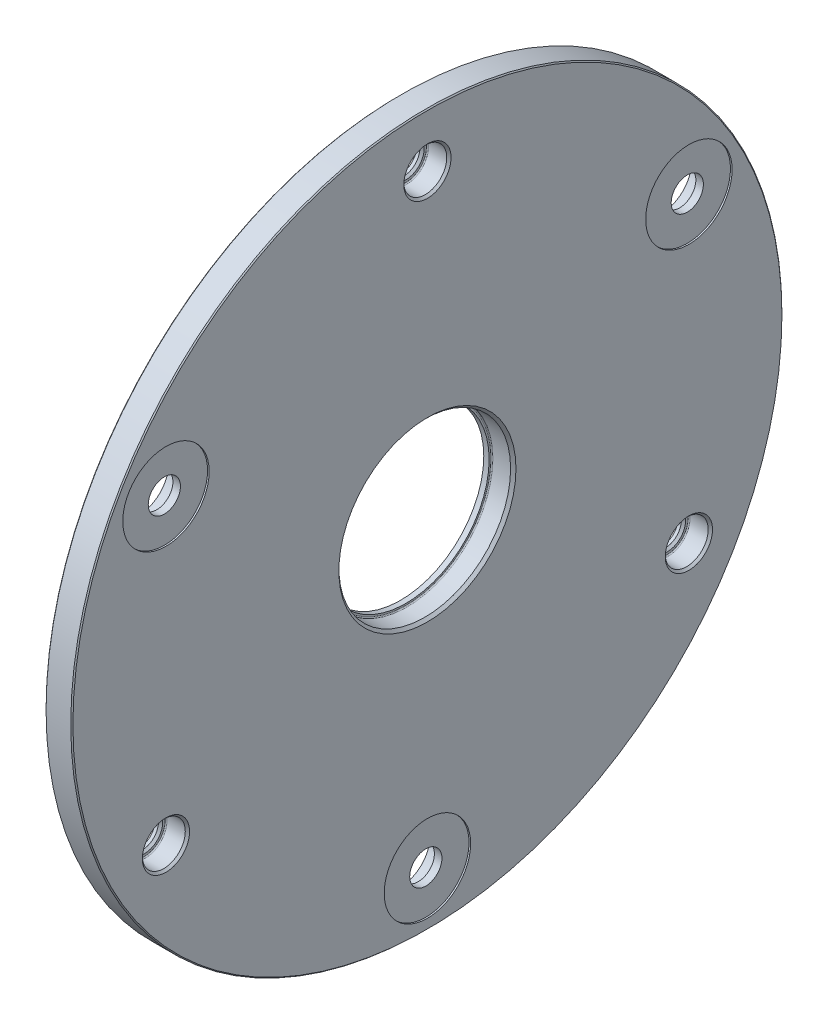
ISO-10303-21;
HEADER;
FILE_DESCRIPTION(('STEP AP214'),'2;1');
FILE_NAME('part.step','',(''),(''),'','','');
FILE_SCHEMA(('AUTOMOTIVE_DESIGN { 1 0 10303 214 1 1 1 1 }'));
ENDSEC;
DATA;
#1=APPLICATION_CONTEXT('core data for automotive mechanical design processes');
#2=APPLICATION_PROTOCOL_DEFINITION('international standard','automotive_design',2000,#1);
#3=PRODUCT_CONTEXT('',#1,'mechanical');
#4=PRODUCT('Part','Part','',(#3));
#5=PRODUCT_RELATED_PRODUCT_CATEGORY('part','',(#4));
#6=PRODUCT_DEFINITION_FORMATION('','',#4);
#7=PRODUCT_DEFINITION_CONTEXT('part definition',#1,'design');
#8=PRODUCT_DEFINITION('design','',#6,#7);
#9=PRODUCT_DEFINITION_SHAPE('','',#8);
#10=(LENGTH_UNIT() NAMED_UNIT(*) SI_UNIT(.MILLI.,.METRE.));
#11=(NAMED_UNIT(*) PLANE_ANGLE_UNIT() SI_UNIT($,.RADIAN.));
#12=(NAMED_UNIT(*) SI_UNIT($,.STERADIAN.) SOLID_ANGLE_UNIT());
#13=UNCERTAINTY_MEASURE_WITH_UNIT(LENGTH_MEASURE(1.E-05),#10,'distance_accuracy_value','');
#14=(GEOMETRIC_REPRESENTATION_CONTEXT(3) GLOBAL_UNCERTAINTY_ASSIGNED_CONTEXT((#13)) GLOBAL_UNIT_ASSIGNED_CONTEXT((#10,
#11,#12)) REPRESENTATION_CONTEXT('',''));
#15=CARTESIAN_POINT('',(0.,0.,0.));
#16=DIRECTION('',(0.,0.,1.));
#17=DIRECTION('',(1.,0.,0.));
#18=AXIS2_PLACEMENT_3D('',#15,#16,#17);
#19=CARTESIAN_POINT('',(-13.4852813742386,-28.1249999999995,48.7139289628749));
#20=DIRECTION('',(1.,0.,0.));
#21=DIRECTION('',(0.,0.,-1.));
#22=AXIS2_PLACEMENT_3D('',#19,#20,#21);
#23=CYLINDRICAL_SURFACE('',#22,3.);
#24=CARTESIAN_POINT('',(-4.39999999999994,-28.1249999999995,48.7139289628749));
#25=DIRECTION('',(1.,0.,0.));
#26=DIRECTION('',(0.,0.,-1.));
#27=AXIS2_PLACEMENT_3D('',#24,#25,#26);
#28=CIRCLE('',#27,3.);
#29=CARTESIAN_POINT('',(-4.39999999999994,-28.1249999999995,45.7139289628749));
#30=VERTEX_POINT('',#29);
#31=EDGE_CURVE('E96',#30,#30,#28,.T.);
#32=ORIENTED_EDGE('',*,*,#31,.T.);
#33=EDGE_LOOP('',(#32));
#34=FACE_BOUND('',#33,.T.);
#35=CARTESIAN_POINT('',(-5.,-28.1249999999995,48.7139289628749));
#36=DIRECTION('',(1.,0.,0.));
#37=DIRECTION('',(0.,0.,-1.));
#38=AXIS2_PLACEMENT_3D('',#35,#36,#37);
#39=CIRCLE('',#38,3.);
#40=CARTESIAN_POINT('',(-5.,-28.1249999999995,45.7139289628749));
#41=VERTEX_POINT('',#40);
#42=EDGE_CURVE('E154',#41,#41,#39,.F.);
#43=ORIENTED_EDGE('',*,*,#42,.T.);
#44=EDGE_LOOP('',(#43));
#45=FACE_BOUND('',#44,.T.);
#46=ADVANCED_FACE('F35',(#34,#45),#23,.F.);
#47=CARTESIAN_POINT('',(-13.4852813742386,-28.1250000000002,-48.7139289628746));
#48=DIRECTION('',(1.,0.,0.));
#49=DIRECTION('',(0.,0.,-1.));
#50=AXIS2_PLACEMENT_3D('',#47,#48,#49);
#51=CYLINDRICAL_SURFACE('',#50,3.);
#52=CARTESIAN_POINT('',(-4.39999999999994,-28.1250000000002,-48.7139289628746));
#53=DIRECTION('',(1.,0.,0.));
#54=DIRECTION('',(0.,0.,-1.));
#55=AXIS2_PLACEMENT_3D('',#52,#53,#54);
#56=CIRCLE('',#55,3.);
#57=CARTESIAN_POINT('',(-4.39999999999994,-28.1250000000002,-51.7139289628746));
#58=VERTEX_POINT('',#57);
#59=EDGE_CURVE('E108',#58,#58,#56,.T.);
#60=ORIENTED_EDGE('',*,*,#59,.T.);
#61=EDGE_LOOP('',(#60));
#62=FACE_BOUND('',#61,.T.);
#63=CARTESIAN_POINT('',(-5.,-28.1250000000002,-48.7139289628746));
#64=DIRECTION('',(1.,0.,0.));
#65=DIRECTION('',(0.,0.,-1.));
#66=AXIS2_PLACEMENT_3D('',#63,#64,#65);
#67=CIRCLE('',#66,3.);
#68=CARTESIAN_POINT('',(-5.,-28.1250000000002,-51.7139289628746));
#69=VERTEX_POINT('',#68);
#70=EDGE_CURVE('E153',#69,#69,#67,.F.);
#71=ORIENTED_EDGE('',*,*,#70,.T.);
#72=EDGE_LOOP('',(#71));
#73=FACE_BOUND('',#72,.T.);
#74=ADVANCED_FACE('F210',(#62,#73),#51,.F.);
#75=CARTESIAN_POINT('',(-13.4852813742386,56.25,0.));
#76=DIRECTION('',(1.,0.,0.));
#77=DIRECTION('',(0.,0.,-1.));
#78=AXIS2_PLACEMENT_3D('',#75,#76,#77);
#79=CYLINDRICAL_SURFACE('',#78,3.);
#80=CARTESIAN_POINT('',(-4.39999999999998,56.25,0.));
#81=DIRECTION('',(1.,0.,0.));
#82=DIRECTION('',(0.,0.,-1.));
#83=AXIS2_PLACEMENT_3D('',#80,#81,#82);
#84=CIRCLE('',#83,3.);
#85=CARTESIAN_POINT('',(-4.39999999999998,56.25,-3.));
#86=VERTEX_POINT('',#85);
#87=EDGE_CURVE('E131',#86,#86,#84,.T.);
#88=ORIENTED_EDGE('',*,*,#87,.T.);
#89=EDGE_LOOP('',(#88));
#90=FACE_BOUND('',#89,.T.);
#91=CARTESIAN_POINT('',(-5.,56.25,0.));
#92=DIRECTION('',(1.,0.,0.));
#93=DIRECTION('',(0.,0.,-1.));
#94=AXIS2_PLACEMENT_3D('',#91,#92,#93);
#95=CIRCLE('',#94,3.);
#96=CARTESIAN_POINT('',(-5.,56.25,-3.));
#97=VERTEX_POINT('',#96);
#98=EDGE_CURVE('E137',#97,#97,#95,.F.);
#99=ORIENTED_EDGE('',*,*,#98,.T.);
#100=EDGE_LOOP('',(#99));
#101=FACE_BOUND('',#100,.T.);
#102=ADVANCED_FACE('F216',(#90,#101),#79,.F.);
#103=CARTESIAN_POINT('',(-5.,0.,0.));
#104=DIRECTION('',(1.,0.,0.));
#105=DIRECTION('',(0.,0.,-1.));
#106=AXIS2_PLACEMENT_3D('',#103,#104,#105);
#107=CYLINDRICAL_SURFACE('',#106,66.25);
#108=CARTESIAN_POINT('',(-0.20000000000002,0.,0.));
#109=DIRECTION('',(1.,0.,0.));
#110=DIRECTION('',(0.,0.,-1.));
#111=AXIS2_PLACEMENT_3D('',#108,#109,#110);
#112=CIRCLE('',#111,66.25);
#113=CARTESIAN_POINT('',(-0.20000000000002,0.,-66.25));
#114=VERTEX_POINT('',#113);
#115=EDGE_CURVE('E43',#114,#114,#112,.F.);
#116=ORIENTED_EDGE('',*,*,#115,.T.);
#117=EDGE_LOOP('',(#116));
#118=FACE_BOUND('',#117,.T.);
#119=CARTESIAN_POINT('',(-4.80000000000001,0.,0.));
#120=DIRECTION('',(1.,0.,0.));
#121=DIRECTION('',(0.,0.,-1.));
#122=AXIS2_PLACEMENT_3D('',#119,#120,#121);
#123=CIRCLE('',#122,66.25);
#124=CARTESIAN_POINT('',(-4.80000000000001,0.,-66.25));
#125=VERTEX_POINT('',#124);
#126=EDGE_CURVE('E47',#125,#125,#123,.T.);
#127=ORIENTED_EDGE('',*,*,#126,.T.);
#128=EDGE_LOOP('',(#127));
#129=FACE_BOUND('',#128,.T.);
#130=ADVANCED_FACE('F256',(#118,#129),#107,.T.);
#131=CARTESIAN_POINT('',(-5.,0.,0.));
#132=DIRECTION('',(1.,0.,0.));
#133=DIRECTION('',(0.,0.,-1.));
#134=AXIS2_PLACEMENT_3D('',#131,#132,#133);
#135=PLANE('',#134);
#136=CARTESIAN_POINT('',(-5.,0.,0.));
#137=DIRECTION('',(1.,0.,0.));
#138=DIRECTION('',(0.,0.,-1.));
#139=AXIS2_PLACEMENT_3D('',#136,#137,#138);
#140=CIRCLE('',#139,66.05);
#141=CARTESIAN_POINT('',(-5.,0.,-66.05));
#142=VERTEX_POINT('',#141);
#143=EDGE_CURVE('E11',#142,#142,#140,.F.);
#144=ORIENTED_EDGE('',*,*,#143,.T.);
#145=EDGE_LOOP('',(#144));
#146=FACE_BOUND('',#145,.T.);
#147=CARTESIAN_POINT('',(-5.,28.1250000000004,48.7139289628745));
#148=DIRECTION('',(-1.,0.,0.));
#149=DIRECTION('',(0.,0.,1.));
#150=AXIS2_PLACEMENT_3D('',#147,#148,#149);
#151=CIRCLE('',#150,5.5);
#152=CARTESIAN_POINT('',(-5.,28.1250000000004,54.2139289628745));
#153=VERTEX_POINT('',#152);
#154=EDGE_CURVE('E182',#153,#153,#151,.T.);
#155=ORIENTED_EDGE('',*,*,#154,.F.);
#156=EDGE_LOOP('',(#155));
#157=FACE_BOUND('',#156,.T.);
#158=CARTESIAN_POINT('',(-5.,-56.25,1.73472347597681E-13));
#159=DIRECTION('',(-1.,0.,0.));
#160=DIRECTION('',(0.,0.,1.));
#161=AXIS2_PLACEMENT_3D('',#158,#159,#160);
#162=CIRCLE('',#161,5.5);
#163=CARTESIAN_POINT('',(-5.,-56.25,5.50000000000017));
#164=VERTEX_POINT('',#163);
#165=EDGE_CURVE('E72',#164,#164,#162,.T.);
#166=ORIENTED_EDGE('',*,*,#165,.F.);
#167=EDGE_LOOP('',(#166));
#168=FACE_BOUND('',#167,.T.);
#169=ORIENTED_EDGE('',*,*,#70,.F.);
#170=EDGE_LOOP('',(#169));
#171=FACE_BOUND('',#170,.T.);
#172=ORIENTED_EDGE('',*,*,#42,.F.);
#173=EDGE_LOOP('',(#172));
#174=FACE_BOUND('',#173,.T.);
#175=CARTESIAN_POINT('',(-5.,28.1250000000001,-48.7139289628746));
#176=DIRECTION('',(-1.,0.,0.));
#177=DIRECTION('',(0.,0.,1.));
#178=AXIS2_PLACEMENT_3D('',#175,#176,#177);
#179=CIRCLE('',#178,5.5);
#180=CARTESIAN_POINT('',(-5.,28.1250000000001,-43.2139289628746));
#181=VERTEX_POINT('',#180);
#182=EDGE_CURVE('E150',#181,#181,#179,.T.);
#183=ORIENTED_EDGE('',*,*,#182,.F.);
#184=EDGE_LOOP('',(#183));
#185=FACE_BOUND('',#184,.T.);
#186=ORIENTED_EDGE('',*,*,#98,.F.);
#187=EDGE_LOOP('',(#186));
#188=FACE_BOUND('',#187,.T.);
#189=CARTESIAN_POINT('',(-5.,0.,0.));
#190=DIRECTION('',(1.,0.,0.));
#191=DIRECTION('',(0.,0.,-1.));
#192=AXIS2_PLACEMENT_3D('',#189,#190,#191);
#193=CIRCLE('',#192,15.5);
#194=CARTESIAN_POINT('',(-5.,0.,-15.5));
#195=VERTEX_POINT('',#194);
#196=EDGE_CURVE('E186',#195,#195,#193,.T.);
#197=ORIENTED_EDGE('',*,*,#196,.T.);
#198=EDGE_LOOP('',(#197));
#199=FACE_BOUND('',#198,.T.);
#200=ADVANCED_FACE('F262',(#146,#157,#168,#171,#174,#185,#188,#199),#135,.F.);
#201=CARTESIAN_POINT('',(0.,0.,0.));
#202=DIRECTION('',(1.,0.,0.));
#203=DIRECTION('',(0.,0.,-1.));
#204=AXIS2_PLACEMENT_3D('',#201,#202,#203);
#205=PLANE('',#204);
#206=CARTESIAN_POINT('',(0.,0.,0.));
#207=DIRECTION('',(1.,0.,0.));
#208=DIRECTION('',(0.,0.,-1.));
#209=AXIS2_PLACEMENT_3D('',#206,#207,#208);
#210=CIRCLE('',#209,66.05);
#211=CARTESIAN_POINT('',(0.,0.,-66.05));
#212=VERTEX_POINT('',#211);
#213=EDGE_CURVE('E51',#212,#212,#210,.T.);
#214=ORIENTED_EDGE('',*,*,#213,.T.);
#215=EDGE_LOOP('',(#214));
#216=FACE_BOUND('',#215,.T.);
#217=CARTESIAN_POINT('',(0.,0.,0.));
#218=DIRECTION('',(1.,0.,0.));
#219=DIRECTION('',(0.,0.,-1.));
#220=AXIS2_PLACEMENT_3D('',#217,#218,#219);
#221=CIRCLE('',#220,16.5);
#222=CARTESIAN_POINT('',(0.,0.,-16.5));
#223=VERTEX_POINT('',#222);
#224=EDGE_CURVE('E56',#223,#223,#221,.F.);
#225=ORIENTED_EDGE('',*,*,#224,.T.);
#226=EDGE_LOOP('',(#225));
#227=FACE_BOUND('',#226,.T.);
#228=CARTESIAN_POINT('',(0.,-56.25,1.73472347597681E-13));
#229=DIRECTION('',(1.,0.,0.));
#230=DIRECTION('',(0.,-0.866025403784436,0.500000000000004));
#231=AXIS2_PLACEMENT_3D('',#228,#229,#230);
#232=CIRCLE('',#231,8.05000000000001);
#233=CARTESIAN_POINT('',(0.,-63.2215045004647,4.02500000000021));
#234=VERTEX_POINT('',#233);
#235=EDGE_CURVE('E165',#234,#234,#232,.T.);
#236=ORIENTED_EDGE('',*,*,#235,.F.);
#237=EDGE_LOOP('',(#236));
#238=FACE_BOUND('',#237,.T.);
#239=CARTESIAN_POINT('',(0.,28.1250000000004,48.7139289628745));
#240=DIRECTION('',(1.,0.,0.));
#241=DIRECTION('',(0.,0.866025403784443,0.499999999999992));
#242=AXIS2_PLACEMENT_3D('',#239,#240,#241);
#243=CIRCLE('',#242,8.05000000000001);
#244=CARTESIAN_POINT('',(0.,35.0965045004652,52.7389289628744));
#245=VERTEX_POINT('',#244);
#246=EDGE_CURVE('E77',#245,#245,#243,.T.);
#247=ORIENTED_EDGE('',*,*,#246,.F.);
#248=EDGE_LOOP('',(#247));
#249=FACE_BOUND('',#248,.T.);
#250=CARTESIAN_POINT('',(0.,-28.1249999999995,48.7139289628749));
#251=DIRECTION('',(1.,0.,0.));
#252=DIRECTION('',(0.,0.,-1.));
#253=AXIS2_PLACEMENT_3D('',#250,#251,#252);
#254=CIRCLE('',#253,4.39999999999999);
#255=CARTESIAN_POINT('',(0.,-28.1249999999995,44.3139289628749));
#256=VERTEX_POINT('',#255);
#257=EDGE_CURVE('E90',#256,#256,#254,.F.);
#258=ORIENTED_EDGE('',*,*,#257,.T.);
#259=EDGE_LOOP('',(#258));
#260=FACE_BOUND('',#259,.T.);
#261=CARTESIAN_POINT('',(0.,-28.1250000000002,-48.7139289628746));
#262=DIRECTION('',(1.,0.,0.));
#263=DIRECTION('',(0.,0.,-1.));
#264=AXIS2_PLACEMENT_3D('',#261,#262,#263);
#265=CIRCLE('',#264,4.39999999999994);
#266=CARTESIAN_POINT('',(0.,-28.1250000000002,-53.1139289628745));
#267=VERTEX_POINT('',#266);
#268=EDGE_CURVE('E102',#267,#267,#265,.F.);
#269=ORIENTED_EDGE('',*,*,#268,.T.);
#270=EDGE_LOOP('',(#269));
#271=FACE_BOUND('',#270,.T.);
#272=CARTESIAN_POINT('',(0.,28.1250000000001,-48.7139289628746));
#273=DIRECTION('',(1.,0.,0.));
#274=DIRECTION('',(0.,0.,-1.));
#275=AXIS2_PLACEMENT_3D('',#272,#273,#274);
#276=CIRCLE('',#275,8.05000000000001);
#277=CARTESIAN_POINT('',(0.,28.1250000000001,-56.7639289628746));
#278=VERTEX_POINT('',#277);
#279=EDGE_CURVE('E118',#278,#278,#276,.T.);
#280=ORIENTED_EDGE('',*,*,#279,.F.);
#281=EDGE_LOOP('',(#280));
#282=FACE_BOUND('',#281,.T.);
#283=CARTESIAN_POINT('',(0.,56.25,0.));
#284=DIRECTION('',(1.,0.,0.));
#285=DIRECTION('',(0.,0.,-1.));
#286=AXIS2_PLACEMENT_3D('',#283,#284,#285);
#287=CIRCLE('',#286,4.39999999999993);
#288=CARTESIAN_POINT('',(0.,56.25,-4.39999999999993));
#289=VERTEX_POINT('',#288);
#290=EDGE_CURVE('E125',#289,#289,#287,.F.);
#291=ORIENTED_EDGE('',*,*,#290,.T.);
#292=EDGE_LOOP('',(#291));
#293=FACE_BOUND('',#292,.T.);
#294=ADVANCED_FACE('F260',(#216,#227,#238,#249,#260,#271,#282,#293),#205,.T.);
#295=CARTESIAN_POINT('',(-5.,0.,0.));
#296=DIRECTION('',(1.,0.,0.));
#297=DIRECTION('',(0.,0.,-1.));
#298=AXIS2_PLACEMENT_3D('',#295,#296,#297);
#299=CYLINDRICAL_SURFACE('',#298,16.);
#300=CARTESIAN_POINT('',(-0.500000000000014,0.,0.));
#301=DIRECTION('',(1.,0.,0.));
#302=DIRECTION('',(0.,0.,-1.));
#303=AXIS2_PLACEMENT_3D('',#300,#301,#302);
#304=CIRCLE('',#303,16.);
#305=CARTESIAN_POINT('',(-0.500000000000014,0.,-16.));
#306=VERTEX_POINT('',#305);
#307=EDGE_CURVE('E59',#306,#306,#304,.T.);
#308=ORIENTED_EDGE('',*,*,#307,.T.);
#309=EDGE_LOOP('',(#308));
#310=FACE_BOUND('',#309,.T.);
#311=CARTESIAN_POINT('',(-3.8,0.,0.));
#312=DIRECTION('',(1.,0.,0.));
#313=DIRECTION('',(0.,0.,-1.));
#314=AXIS2_PLACEMENT_3D('',#311,#312,#313);
#315=CIRCLE('',#314,16.);
#316=CARTESIAN_POINT('',(-3.8,0.,-16.));
#317=VERTEX_POINT('',#316);
#318=EDGE_CURVE('E62',#317,#317,#315,.F.);
#319=ORIENTED_EDGE('',*,*,#318,.T.);
#320=EDGE_LOOP('',(#319));
#321=FACE_BOUND('',#320,.T.);
#322=ADVANCED_FACE('F252',(#310,#321),#299,.F.);
#323=CARTESIAN_POINT('',(-16.3137084989848,56.25,0.));
#324=DIRECTION('',(1.,0.,0.));
#325=DIRECTION('',(0.,0.,-1.));
#326=AXIS2_PLACEMENT_3D('',#323,#324,#325);
#327=CYLINDRICAL_SURFACE('',#326,4.);
#328=CARTESIAN_POINT('',(-3.8,56.25,0.));
#329=DIRECTION('',(1.,0.,0.));
#330=DIRECTION('',(0.,0.,-1.));
#331=AXIS2_PLACEMENT_3D('',#328,#329,#330);
#332=CIRCLE('',#331,4.);
#333=CARTESIAN_POINT('',(-3.8,56.25,-4.));
#334=VERTEX_POINT('',#333);
#335=EDGE_CURVE('E122',#334,#334,#332,.F.);
#336=ORIENTED_EDGE('',*,*,#335,.T.);
#337=EDGE_LOOP('',(#336));
#338=FACE_BOUND('',#337,.T.);
#339=CARTESIAN_POINT('',(-0.399999999999946,56.25,0.));
#340=DIRECTION('',(1.,0.,0.));
#341=DIRECTION('',(0.,0.,-1.));
#342=AXIS2_PLACEMENT_3D('',#339,#340,#341);
#343=CIRCLE('',#342,4.);
#344=CARTESIAN_POINT('',(-0.399999999999946,56.25,-4.));
#345=VERTEX_POINT('',#344);
#346=EDGE_CURVE('E128',#345,#345,#343,.T.);
#347=ORIENTED_EDGE('',*,*,#346,.T.);
#348=EDGE_LOOP('',(#347));
#349=FACE_BOUND('',#348,.T.);
#350=ADVANCED_FACE('F248',(#338,#349),#327,.F.);
#351=CARTESIAN_POINT('',(-4.,0.,0.));
#352=DIRECTION('',(1.,0.,0.));
#353=DIRECTION('',(0.,0.,-1.));
#354=AXIS2_PLACEMENT_3D('',#351,#352,#353);
#355=PLANE('',#354);
#356=CARTESIAN_POINT('',(-4.,56.25,0.));
#357=DIRECTION('',(1.,0.,0.));
#358=DIRECTION('',(0.,0.,-1.));
#359=AXIS2_PLACEMENT_3D('',#356,#357,#358);
#360=CIRCLE('',#359,3.8);
#361=CARTESIAN_POINT('',(-4.,56.25,-3.8));
#362=VERTEX_POINT('',#361);
#363=EDGE_CURVE('E114',#362,#362,#360,.T.);
#364=ORIENTED_EDGE('',*,*,#363,.T.);
#365=EDGE_LOOP('',(#364));
#366=FACE_BOUND('',#365,.T.);
#367=CARTESIAN_POINT('',(-4.,56.25,0.));
#368=DIRECTION('',(1.,0.,0.));
#369=DIRECTION('',(0.,0.,-1.));
#370=AXIS2_PLACEMENT_3D('',#367,#368,#369);
#371=CIRCLE('',#370,3.39999999999999);
#372=CARTESIAN_POINT('',(-4.,56.25,-3.39999999999999));
#373=VERTEX_POINT('',#372);
#374=EDGE_CURVE('E134',#373,#373,#371,.F.);
#375=ORIENTED_EDGE('',*,*,#374,.T.);
#376=EDGE_LOOP('',(#375));
#377=FACE_BOUND('',#376,.T.);
#378=ADVANCED_FACE('F244',(#366,#377),#355,.T.);
#379=CARTESIAN_POINT('',(-4.,56.25,0.));
#380=DIRECTION('',(1.,0.,0.));
#381=DIRECTION('',(0.,0.,-1.));
#382=AXIS2_PLACEMENT_3D('',#379,#380,#381);
#383=CONICAL_SURFACE('',#382,3.39999999999999,0.785398163397459);
#384=ORIENTED_EDGE('',*,*,#87,.F.);
#385=EDGE_LOOP('',(#384));
#386=FACE_BOUND('',#385,.T.);
#387=ORIENTED_EDGE('',*,*,#374,.F.);
#388=EDGE_LOOP('',(#387));
#389=FACE_BOUND('',#388,.T.);
#390=ADVANCED_FACE('F247',(#386,#389),#383,.F.);
#391=CARTESIAN_POINT('',(-0.399999999999946,56.25,0.));
#392=DIRECTION('',(1.,0.,0.));
#393=DIRECTION('',(0.,0.,-1.));
#394=AXIS2_PLACEMENT_3D('',#391,#392,#393);
#395=CONICAL_SURFACE('',#394,4.,0.78539816339743);
#396=ORIENTED_EDGE('',*,*,#290,.F.);
#397=EDGE_LOOP('',(#396));
#398=FACE_BOUND('',#397,.T.);
#399=ORIENTED_EDGE('',*,*,#346,.F.);
#400=EDGE_LOOP('',(#399));
#401=FACE_BOUND('',#400,.T.);
#402=ADVANCED_FACE('F276',(#398,#401),#395,.F.);
#403=CARTESIAN_POINT('',(-3.8,56.25,0.));
#404=DIRECTION('',(1.,0.,0.));
#405=DIRECTION('',(0.,0.,-1.));
#406=AXIS2_PLACEMENT_3D('',#403,#404,#405);
#407=TOROIDAL_SURFACE('',#406,3.8,0.2);
#408=ORIENTED_EDGE('',*,*,#363,.F.);
#409=EDGE_LOOP('',(#408));
#410=FACE_BOUND('',#409,.T.);
#411=ORIENTED_EDGE('',*,*,#335,.F.);
#412=EDGE_LOOP('',(#411));
#413=FACE_BOUND('',#412,.T.);
#414=ADVANCED_FACE('F242',(#410,#413),#407,.F.);
#415=CARTESIAN_POINT('',(-0.3,28.1250000000001,-48.7139289628746));
#416=DIRECTION('',(1.,0.,0.));
#417=DIRECTION('',(0.,0.,-1.));
#418=AXIS2_PLACEMENT_3D('',#415,#416,#417);
#419=CYLINDRICAL_SURFACE('',#418,8.05000000000001);
#420=CARTESIAN_POINT('',(-0.3,28.1250000000001,-48.7139289628746));
#421=DIRECTION('',(1.,0.,0.));
#422=DIRECTION('',(0.,0.,-1.));
#423=AXIS2_PLACEMENT_3D('',#420,#421,#422);
#424=CIRCLE('',#423,8.05000000000001);
#425=CARTESIAN_POINT('',(-0.3,28.1250000000001,-56.7639289628746));
#426=VERTEX_POINT('',#425);
#427=EDGE_CURVE('E140',#426,#426,#424,.T.);
#428=ORIENTED_EDGE('',*,*,#427,.F.);
#429=EDGE_LOOP('',(#428));
#430=FACE_BOUND('',#429,.T.);
#431=ORIENTED_EDGE('',*,*,#279,.T.);
#432=EDGE_LOOP('',(#431));
#433=FACE_BOUND('',#432,.T.);
#434=ADVANCED_FACE('F238',(#430,#433),#419,.F.);
#435=CARTESIAN_POINT('',(-0.3,0.,0.));
#436=DIRECTION('',(1.,0.,0.));
#437=DIRECTION('',(0.,0.,-1.));
#438=AXIS2_PLACEMENT_3D('',#435,#436,#437);
#439=PLANE('',#438);
#440=CARTESIAN_POINT('',(-0.3,28.1250000000001,-48.7139289628746));
#441=DIRECTION('',(1.,0.,0.));
#442=DIRECTION('',(0.,0.,-1.));
#443=AXIS2_PLACEMENT_3D('',#440,#441,#442);
#444=CIRCLE('',#443,3.);
#445=CARTESIAN_POINT('',(-0.3,28.1250000000001,-51.7139289628746));
#446=VERTEX_POINT('',#445);
#447=EDGE_CURVE('E115',#446,#446,#444,.T.);
#448=ORIENTED_EDGE('',*,*,#447,.F.);
#449=EDGE_LOOP('',(#448));
#450=FACE_BOUND('',#449,.T.);
#451=ORIENTED_EDGE('',*,*,#427,.T.);
#452=EDGE_LOOP('',(#451));
#453=FACE_BOUND('',#452,.T.);
#454=ADVANCED_FACE('F234',(#450,#453),#439,.T.);
#455=CARTESIAN_POINT('',(-5.,28.1250000000001,-48.7139289628746));
#456=DIRECTION('',(-1.,0.,0.));
#457=DIRECTION('',(0.,0.,1.));
#458=AXIS2_PLACEMENT_3D('',#455,#456,#457);
#459=CYLINDRICAL_SURFACE('',#458,3.);
#460=ORIENTED_EDGE('',*,*,#447,.T.);
#461=EDGE_LOOP('',(#460));
#462=FACE_BOUND('',#461,.T.);
#463=CARTESIAN_POINT('',(-1.7,28.1250000000001,-48.7139289628746));
#464=DIRECTION('',(-1.,0.,0.));
#465=DIRECTION('',(0.,0.,1.));
#466=AXIS2_PLACEMENT_3D('',#463,#464,#465);
#467=CIRCLE('',#466,3.);
#468=CARTESIAN_POINT('',(-1.7,28.1250000000001,-45.7139289628746));
#469=VERTEX_POINT('',#468);
#470=EDGE_CURVE('E119',#469,#469,#467,.T.);
#471=ORIENTED_EDGE('',*,*,#470,.T.);
#472=EDGE_LOOP('',(#471));
#473=FACE_BOUND('',#472,.T.);
#474=ADVANCED_FACE('F230',(#462,#473),#459,.F.);
#475=CARTESIAN_POINT('',(-1.7,31.1250000000001,-48.7139289628746));
#476=DIRECTION('',(1.,0.,0.));
#477=DIRECTION('',(0.,0.,-1.));
#478=AXIS2_PLACEMENT_3D('',#475,#476,#477);
#479=PLANE('',#478);
#480=ORIENTED_EDGE('',*,*,#470,.F.);
#481=EDGE_LOOP('',(#480));
#482=FACE_BOUND('',#481,.T.);
#483=CARTESIAN_POINT('',(-1.7,28.1250000000001,-48.7139289628746));
#484=DIRECTION('',(-1.,0.,0.));
#485=DIRECTION('',(0.,0.,1.));
#486=AXIS2_PLACEMENT_3D('',#483,#484,#485);
#487=CIRCLE('',#486,5.5);
#488=CARTESIAN_POINT('',(-1.7,28.1250000000001,-43.2139289628746));
#489=VERTEX_POINT('',#488);
#490=EDGE_CURVE('E147',#489,#489,#487,.T.);
#491=ORIENTED_EDGE('',*,*,#490,.T.);
#492=EDGE_LOOP('',(#491));
#493=FACE_BOUND('',#492,.T.);
#494=ADVANCED_FACE('F226',(#482,#493),#479,.F.);
#495=CARTESIAN_POINT('',(-5.,28.1250000000001,-48.7139289628746));
#496=DIRECTION('',(-1.,0.,0.));
#497=DIRECTION('',(0.,0.,1.));
#498=AXIS2_PLACEMENT_3D('',#495,#496,#497);
#499=CYLINDRICAL_SURFACE('',#498,5.5);
#500=ORIENTED_EDGE('',*,*,#490,.F.);
#501=EDGE_LOOP('',(#500));
#502=FACE_BOUND('',#501,.T.);
#503=ORIENTED_EDGE('',*,*,#182,.T.);
#504=EDGE_LOOP('',(#503));
#505=FACE_BOUND('',#504,.T.);
#506=ADVANCED_FACE('F222',(#502,#505),#499,.F.);
#507=CARTESIAN_POINT('',(-16.3137084989848,-28.1250000000002,-48.7139289628746));
#508=DIRECTION('',(1.,0.,0.));
#509=DIRECTION('',(0.,0.,-1.));
#510=AXIS2_PLACEMENT_3D('',#507,#508,#509);
#511=CYLINDRICAL_SURFACE('',#510,4.);
#512=CARTESIAN_POINT('',(-3.8,-28.1250000000002,-48.7139289628746));
#513=DIRECTION('',(1.,0.,0.));
#514=DIRECTION('',(0.,0.,-1.));
#515=AXIS2_PLACEMENT_3D('',#512,#513,#514);
#516=CIRCLE('',#515,4.);
#517=CARTESIAN_POINT('',(-3.8,-28.1250000000002,-52.7139289628746));
#518=VERTEX_POINT('',#517);
#519=EDGE_CURVE('E87',#518,#518,#516,.F.);
#520=ORIENTED_EDGE('',*,*,#519,.T.);
#521=EDGE_LOOP('',(#520));
#522=FACE_BOUND('',#521,.T.);
#523=CARTESIAN_POINT('',(-0.399999999999946,-28.1250000000002,-48.7139289628746));
#524=DIRECTION('',(1.,0.,0.));
#525=DIRECTION('',(0.,0.,-1.));
#526=AXIS2_PLACEMENT_3D('',#523,#524,#525);
#527=CIRCLE('',#526,4.);
#528=CARTESIAN_POINT('',(-0.399999999999946,-28.1250000000002,-52.7139289628746));
#529=VERTEX_POINT('',#528);
#530=EDGE_CURVE('E105',#529,#529,#527,.T.);
#531=ORIENTED_EDGE('',*,*,#530,.T.);
#532=EDGE_LOOP('',(#531));
#533=FACE_BOUND('',#532,.T.);
#534=ADVANCED_FACE('F225',(#522,#533),#511,.F.);
#535=CARTESIAN_POINT('',(-4.,0.,0.));
#536=DIRECTION('',(1.,0.,0.));
#537=DIRECTION('',(0.,0.,-1.));
#538=AXIS2_PLACEMENT_3D('',#535,#536,#537);
#539=PLANE('',#538);
#540=CARTESIAN_POINT('',(-4.,-28.1250000000002,-48.7139289628746));
#541=DIRECTION('',(1.,0.,0.));
#542=DIRECTION('',(0.,0.,-1.));
#543=AXIS2_PLACEMENT_3D('',#540,#541,#542);
#544=CIRCLE('',#543,3.8);
#545=CARTESIAN_POINT('',(-4.,-28.1250000000002,-52.5139289628746));
#546=VERTEX_POINT('',#545);
#547=EDGE_CURVE('E84',#546,#546,#544,.T.);
#548=ORIENTED_EDGE('',*,*,#547,.T.);
#549=EDGE_LOOP('',(#548));
#550=FACE_BOUND('',#549,.T.);
#551=CARTESIAN_POINT('',(-4.,-28.1250000000002,-48.7139289628746));
#552=DIRECTION('',(1.,0.,0.));
#553=DIRECTION('',(0.,0.,-1.));
#554=AXIS2_PLACEMENT_3D('',#551,#552,#553);
#555=CIRCLE('',#554,3.3999999999999);
#556=CARTESIAN_POINT('',(-4.,-28.1250000000002,-52.1139289628745));
#557=VERTEX_POINT('',#556);
#558=EDGE_CURVE('E111',#557,#557,#555,.F.);
#559=ORIENTED_EDGE('',*,*,#558,.T.);
#560=EDGE_LOOP('',(#559));
#561=FACE_BOUND('',#560,.T.);
#562=ADVANCED_FACE('F367',(#550,#561),#539,.T.);
#563=CARTESIAN_POINT('',(-16.3137084989848,-28.1249999999995,48.7139289628749));
#564=DIRECTION('',(1.,0.,0.));
#565=DIRECTION('',(0.,0.,-1.));
#566=AXIS2_PLACEMENT_3D('',#563,#564,#565);
#567=CYLINDRICAL_SURFACE('',#566,4.);
#568=CARTESIAN_POINT('',(-3.8,-28.1249999999995,48.7139289628749));
#569=DIRECTION('',(1.,0.,0.));
#570=DIRECTION('',(0.,0.,-1.));
#571=AXIS2_PLACEMENT_3D('',#568,#569,#570);
#572=CIRCLE('',#571,4.);
#573=CARTESIAN_POINT('',(-3.8,-28.1249999999995,44.7139289628749));
#574=VERTEX_POINT('',#573);
#575=EDGE_CURVE('E81',#574,#574,#572,.F.);
#576=ORIENTED_EDGE('',*,*,#575,.T.);
#577=EDGE_LOOP('',(#576));
#578=FACE_BOUND('',#577,.T.);
#579=CARTESIAN_POINT('',(-0.400000000000001,-28.1249999999995,48.7139289628749));
#580=DIRECTION('',(1.,0.,0.));
#581=DIRECTION('',(0.,0.,-1.));
#582=AXIS2_PLACEMENT_3D('',#579,#580,#581);
#583=CIRCLE('',#582,4.);
#584=CARTESIAN_POINT('',(-0.400000000000001,-28.1249999999995,44.7139289628749));
#585=VERTEX_POINT('',#584);
#586=EDGE_CURVE('E93',#585,#585,#583,.T.);
#587=ORIENTED_EDGE('',*,*,#586,.T.);
#588=EDGE_LOOP('',(#587));
#589=FACE_BOUND('',#588,.T.);
#590=ADVANCED_FACE('F373',(#578,#589),#567,.F.);
#591=CARTESIAN_POINT('',(-4.,0.,0.));
#592=DIRECTION('',(1.,0.,0.));
#593=DIRECTION('',(0.,0.,-1.));
#594=AXIS2_PLACEMENT_3D('',#591,#592,#593);
#595=PLANE('',#594);
#596=CARTESIAN_POINT('',(-4.,-28.1249999999995,48.7139289628749));
#597=DIRECTION('',(1.,0.,0.));
#598=DIRECTION('',(0.,0.,-1.));
#599=AXIS2_PLACEMENT_3D('',#596,#597,#598);
#600=CIRCLE('',#599,3.8);
#601=CARTESIAN_POINT('',(-4.,-28.1249999999995,44.9139289628749));
#602=VERTEX_POINT('',#601);
#603=EDGE_CURVE('E68',#602,#602,#600,.T.);
#604=ORIENTED_EDGE('',*,*,#603,.T.);
#605=EDGE_LOOP('',(#604));
#606=FACE_BOUND('',#605,.T.);
#607=CARTESIAN_POINT('',(-4.,-28.1249999999995,48.7139289628749));
#608=DIRECTION('',(1.,0.,0.));
#609=DIRECTION('',(0.,0.,-1.));
#610=AXIS2_PLACEMENT_3D('',#607,#608,#609);
#611=CIRCLE('',#610,3.3999999999999);
#612=CARTESIAN_POINT('',(-4.,-28.1249999999995,45.313928962875));
#613=VERTEX_POINT('',#612);
#614=EDGE_CURVE('E99',#613,#613,#611,.F.);
#615=ORIENTED_EDGE('',*,*,#614,.T.);
#616=EDGE_LOOP('',(#615));
#617=FACE_BOUND('',#616,.T.);
#618=ADVANCED_FACE('F294',(#606,#617),#595,.T.);
#619=CARTESIAN_POINT('',(-4.,-28.1250000000002,-48.7139289628746));
#620=DIRECTION('',(1.,0.,0.));
#621=DIRECTION('',(0.,0.,-1.));
#622=AXIS2_PLACEMENT_3D('',#619,#620,#621);
#623=CONICAL_SURFACE('',#622,3.3999999999999,0.785398163397401);
#624=ORIENTED_EDGE('',*,*,#59,.F.);
#625=EDGE_LOOP('',(#624));
#626=FACE_BOUND('',#625,.T.);
#627=ORIENTED_EDGE('',*,*,#558,.F.);
#628=EDGE_LOOP('',(#627));
#629=FACE_BOUND('',#628,.T.);
#630=ADVANCED_FACE('F287',(#626,#629),#623,.F.);
#631=CARTESIAN_POINT('',(-0.399999999999946,-28.1250000000002,-48.7139289628746));
#632=DIRECTION('',(1.,0.,0.));
#633=DIRECTION('',(0.,0.,-1.));
#634=AXIS2_PLACEMENT_3D('',#631,#632,#633);
#635=CONICAL_SURFACE('',#634,4.,0.785398163397444);
#636=ORIENTED_EDGE('',*,*,#268,.F.);
#637=EDGE_LOOP('',(#636));
#638=FACE_BOUND('',#637,.T.);
#639=ORIENTED_EDGE('',*,*,#530,.F.);
#640=EDGE_LOOP('',(#639));
#641=FACE_BOUND('',#640,.T.);
#642=ADVANCED_FACE('F293',(#638,#641),#635,.F.);
#643=CARTESIAN_POINT('',(-4.,-28.1249999999995,48.7139289628749));
#644=DIRECTION('',(1.,0.,0.));
#645=DIRECTION('',(0.,0.,-1.));
#646=AXIS2_PLACEMENT_3D('',#643,#644,#645);
#647=CONICAL_SURFACE('',#646,3.3999999999999,0.785398163397401);
#648=ORIENTED_EDGE('',*,*,#31,.F.);
#649=EDGE_LOOP('',(#648));
#650=FACE_BOUND('',#649,.T.);
#651=ORIENTED_EDGE('',*,*,#614,.F.);
#652=EDGE_LOOP('',(#651));
#653=FACE_BOUND('',#652,.T.);
#654=ADVANCED_FACE('F301',(#650,#653),#647,.F.);
#655=CARTESIAN_POINT('',(-0.400000000000001,-28.1249999999995,48.7139289628749));
#656=DIRECTION('',(1.,0.,0.));
#657=DIRECTION('',(0.,0.,-1.));
#658=AXIS2_PLACEMENT_3D('',#655,#656,#657);
#659=CONICAL_SURFACE('',#658,4.,0.785398163397435);
#660=ORIENTED_EDGE('',*,*,#257,.F.);
#661=EDGE_LOOP('',(#660));
#662=FACE_BOUND('',#661,.T.);
#663=ORIENTED_EDGE('',*,*,#586,.F.);
#664=EDGE_LOOP('',(#663));
#665=FACE_BOUND('',#664,.T.);
#666=ADVANCED_FACE('F308',(#662,#665),#659,.F.);
#667=CARTESIAN_POINT('',(-3.8,-28.1250000000002,-48.7139289628746));
#668=DIRECTION('',(1.,0.,0.));
#669=DIRECTION('',(0.,0.,-1.));
#670=AXIS2_PLACEMENT_3D('',#667,#668,#669);
#671=TOROIDAL_SURFACE('',#670,3.8,0.2);
#672=ORIENTED_EDGE('',*,*,#547,.F.);
#673=EDGE_LOOP('',(#672));
#674=FACE_BOUND('',#673,.T.);
#675=ORIENTED_EDGE('',*,*,#519,.F.);
#676=EDGE_LOOP('',(#675));
#677=FACE_BOUND('',#676,.T.);
#678=ADVANCED_FACE('F315',(#674,#677),#671,.F.);
#679=CARTESIAN_POINT('',(-3.8,-28.1249999999995,48.7139289628749));
#680=DIRECTION('',(1.,0.,0.));
#681=DIRECTION('',(0.,0.,-1.));
#682=AXIS2_PLACEMENT_3D('',#679,#680,#681);
#683=TOROIDAL_SURFACE('',#682,3.8,0.2);
#684=ORIENTED_EDGE('',*,*,#603,.F.);
#685=EDGE_LOOP('',(#684));
#686=FACE_BOUND('',#685,.T.);
#687=ORIENTED_EDGE('',*,*,#575,.F.);
#688=EDGE_LOOP('',(#687));
#689=FACE_BOUND('',#688,.T.);
#690=ADVANCED_FACE('F319',(#686,#689),#683,.F.);
#691=CARTESIAN_POINT('',(-0.3,28.1250000000004,48.7139289628745));
#692=DIRECTION('',(1.,0.,0.));
#693=DIRECTION('',(0.,0.,-1.));
#694=AXIS2_PLACEMENT_3D('',#691,#692,#693);
#695=CYLINDRICAL_SURFACE('',#694,8.05000000000001);
#696=CARTESIAN_POINT('',(-0.3,28.1250000000004,48.7139289628745));
#697=DIRECTION('',(1.,0.,0.));
#698=DIRECTION('',(0.,0.866025403784443,0.499999999999992));
#699=AXIS2_PLACEMENT_3D('',#696,#697,#698);
#700=CIRCLE('',#699,8.05000000000001);
#701=CARTESIAN_POINT('',(-0.3,35.0965045004652,52.7389289628744));
#702=VERTEX_POINT('',#701);
#703=EDGE_CURVE('E162',#702,#702,#700,.T.);
#704=ORIENTED_EDGE('',*,*,#703,.F.);
#705=EDGE_LOOP('',(#704));
#706=FACE_BOUND('',#705,.T.);
#707=ORIENTED_EDGE('',*,*,#246,.T.);
#708=EDGE_LOOP('',(#707));
#709=FACE_BOUND('',#708,.T.);
#710=ADVANCED_FACE('F323',(#706,#709),#695,.F.);
#711=CARTESIAN_POINT('',(-0.3,0.,0.));
#712=DIRECTION('',(1.,0.,0.));
#713=DIRECTION('',(0.,0.866025403784443,0.499999999999992));
#714=AXIS2_PLACEMENT_3D('',#711,#712,#713);
#715=PLANE('',#714);
#716=CARTESIAN_POINT('',(-0.3,28.1250000000004,48.7139289628745));
#717=DIRECTION('',(1.,0.,0.));
#718=DIRECTION('',(0.,0.,-1.));
#719=AXIS2_PLACEMENT_3D('',#716,#717,#718);
#720=CIRCLE('',#719,3.);
#721=CARTESIAN_POINT('',(-0.3,28.1250000000004,45.7139289628745));
#722=VERTEX_POINT('',#721);
#723=EDGE_CURVE('E69',#722,#722,#720,.T.);
#724=ORIENTED_EDGE('',*,*,#723,.F.);
#725=EDGE_LOOP('',(#724));
#726=FACE_BOUND('',#725,.T.);
#727=ORIENTED_EDGE('',*,*,#703,.T.);
#728=EDGE_LOOP('',(#727));
#729=FACE_BOUND('',#728,.T.);
#730=ADVANCED_FACE('F425',(#726,#729),#715,.T.);
#731=CARTESIAN_POINT('',(-0.3,-56.25,1.73472347597681E-13));
#732=DIRECTION('',(1.,0.,0.));
#733=DIRECTION('',(0.,0.,-1.));
#734=AXIS2_PLACEMENT_3D('',#731,#732,#733);
#735=CYLINDRICAL_SURFACE('',#734,8.05000000000001);
#736=CARTESIAN_POINT('',(-0.3,-56.25,1.73472347597681E-13));
#737=DIRECTION('',(1.,0.,0.));
#738=DIRECTION('',(0.,-0.866025403784436,0.500000000000004));
#739=AXIS2_PLACEMENT_3D('',#736,#737,#738);
#740=CIRCLE('',#739,8.05000000000001);
#741=CARTESIAN_POINT('',(-0.3,-63.2215045004647,4.02500000000021));
#742=VERTEX_POINT('',#741);
#743=EDGE_CURVE('E157',#742,#742,#740,.T.);
#744=ORIENTED_EDGE('',*,*,#743,.F.);
#745=EDGE_LOOP('',(#744));
#746=FACE_BOUND('',#745,.T.);
#747=ORIENTED_EDGE('',*,*,#235,.T.);
#748=EDGE_LOOP('',(#747));
#749=FACE_BOUND('',#748,.T.);
#750=ADVANCED_FACE('F432',(#746,#749),#735,.F.);
#751=CARTESIAN_POINT('',(-0.3,0.,0.));
#752=DIRECTION('',(1.,0.,0.));
#753=DIRECTION('',(0.,-0.866025403784436,0.500000000000004));
#754=AXIS2_PLACEMENT_3D('',#751,#752,#753);
#755=PLANE('',#754);
#756=CARTESIAN_POINT('',(-0.3,-56.25,1.73472347597681E-13));
#757=DIRECTION('',(1.,0.,0.));
#758=DIRECTION('',(0.,0.,-1.));
#759=AXIS2_PLACEMENT_3D('',#756,#757,#758);
#760=CIRCLE('',#759,3.);
#761=CARTESIAN_POINT('',(-0.3,-56.25,-2.99999999999983));
#762=VERTEX_POINT('',#761);
#763=EDGE_CURVE('E74',#762,#762,#760,.T.);
#764=ORIENTED_EDGE('',*,*,#763,.F.);
#765=EDGE_LOOP('',(#764));
#766=FACE_BOUND('',#765,.T.);
#767=ORIENTED_EDGE('',*,*,#743,.T.);
#768=EDGE_LOOP('',(#767));
#769=FACE_BOUND('',#768,.T.);
#770=ADVANCED_FACE('F440',(#766,#769),#755,.T.);
#771=CARTESIAN_POINT('',(-5.,-56.25,1.73472347597681E-13));
#772=DIRECTION('',(-1.,0.,0.));
#773=DIRECTION('',(0.,0.,1.));
#774=AXIS2_PLACEMENT_3D('',#771,#772,#773);
#775=CYLINDRICAL_SURFACE('',#774,3.);
#776=ORIENTED_EDGE('',*,*,#763,.T.);
#777=EDGE_LOOP('',(#776));
#778=FACE_BOUND('',#777,.T.);
#779=CARTESIAN_POINT('',(-1.7,-56.25,1.73472347597681E-13));
#780=DIRECTION('',(-1.,0.,0.));
#781=DIRECTION('',(0.,0.,1.));
#782=AXIS2_PLACEMENT_3D('',#779,#780,#781);
#783=CIRCLE('',#782,3.);
#784=CARTESIAN_POINT('',(-1.7,-56.25,3.00000000000018));
#785=VERTEX_POINT('',#784);
#786=EDGE_CURVE('E78',#785,#785,#783,.T.);
#787=ORIENTED_EDGE('',*,*,#786,.T.);
#788=EDGE_LOOP('',(#787));
#789=FACE_BOUND('',#788,.T.);
#790=ADVANCED_FACE('F448',(#778,#789),#775,.F.);
#791=CARTESIAN_POINT('',(-1.7,-53.25,1.73472347597681E-13));
#792=DIRECTION('',(1.,0.,0.));
#793=DIRECTION('',(0.,0.,-1.));
#794=AXIS2_PLACEMENT_3D('',#791,#792,#793);
#795=PLANE('',#794);
#796=ORIENTED_EDGE('',*,*,#786,.F.);
#797=EDGE_LOOP('',(#796));
#798=FACE_BOUND('',#797,.T.);
#799=CARTESIAN_POINT('',(-1.7,-56.25,1.73472347597681E-13));
#800=DIRECTION('',(-1.,0.,0.));
#801=DIRECTION('',(0.,0.,1.));
#802=AXIS2_PLACEMENT_3D('',#799,#800,#801);
#803=CIRCLE('',#802,5.5);
#804=CARTESIAN_POINT('',(-1.7,-56.25,5.50000000000017));
#805=VERTEX_POINT('',#804);
#806=EDGE_CURVE('E172',#805,#805,#803,.T.);
#807=ORIENTED_EDGE('',*,*,#806,.T.);
#808=EDGE_LOOP('',(#807));
#809=FACE_BOUND('',#808,.T.);
#810=ADVANCED_FACE('F456',(#798,#809),#795,.F.);
#811=CARTESIAN_POINT('',(-5.,-56.25,1.73472347597681E-13));
#812=DIRECTION('',(-1.,0.,0.));
#813=DIRECTION('',(0.,0.,1.));
#814=AXIS2_PLACEMENT_3D('',#811,#812,#813);
#815=CYLINDRICAL_SURFACE('',#814,5.5);
#816=ORIENTED_EDGE('',*,*,#806,.F.);
#817=EDGE_LOOP('',(#816));
#818=FACE_BOUND('',#817,.T.);
#819=ORIENTED_EDGE('',*,*,#165,.T.);
#820=EDGE_LOOP('',(#819));
#821=FACE_BOUND('',#820,.T.);
#822=ADVANCED_FACE('F464',(#818,#821),#815,.F.);
#823=CARTESIAN_POINT('',(-5.,28.1250000000004,48.7139289628745));
#824=DIRECTION('',(-1.,0.,0.));
#825=DIRECTION('',(0.,0.,1.));
#826=AXIS2_PLACEMENT_3D('',#823,#824,#825);
#827=CYLINDRICAL_SURFACE('',#826,3.);
#828=ORIENTED_EDGE('',*,*,#723,.T.);
#829=EDGE_LOOP('',(#828));
#830=FACE_BOUND('',#829,.T.);
#831=CARTESIAN_POINT('',(-1.7,28.1250000000004,48.7139289628745));
#832=DIRECTION('',(-1.,0.,0.));
#833=DIRECTION('',(0.,0.,1.));
#834=AXIS2_PLACEMENT_3D('',#831,#832,#833);
#835=CIRCLE('',#834,3.);
#836=CARTESIAN_POINT('',(-1.7,28.1250000000004,51.7139289628745));
#837=VERTEX_POINT('',#836);
#838=EDGE_CURVE('E73',#837,#837,#835,.T.);
#839=ORIENTED_EDGE('',*,*,#838,.T.);
#840=EDGE_LOOP('',(#839));
#841=FACE_BOUND('',#840,.T.);
#842=ADVANCED_FACE('F472',(#830,#841),#827,.F.);
#843=CARTESIAN_POINT('',(-1.7,31.1250000000004,48.7139289628745));
#844=DIRECTION('',(1.,0.,0.));
#845=DIRECTION('',(0.,0.,-1.));
#846=AXIS2_PLACEMENT_3D('',#843,#844,#845);
#847=PLANE('',#846);
#848=ORIENTED_EDGE('',*,*,#838,.F.);
#849=EDGE_LOOP('',(#848));
#850=FACE_BOUND('',#849,.T.);
#851=CARTESIAN_POINT('',(-1.7,28.1250000000004,48.7139289628745));
#852=DIRECTION('',(-1.,0.,0.));
#853=DIRECTION('',(0.,0.,1.));
#854=AXIS2_PLACEMENT_3D('',#851,#852,#853);
#855=CIRCLE('',#854,5.5);
#856=CARTESIAN_POINT('',(-1.7,28.1250000000004,54.2139289628745));
#857=VERTEX_POINT('',#856);
#858=EDGE_CURVE('E179',#857,#857,#855,.T.);
#859=ORIENTED_EDGE('',*,*,#858,.T.);
#860=EDGE_LOOP('',(#859));
#861=FACE_BOUND('',#860,.T.);
#862=ADVANCED_FACE('F206',(#850,#861),#847,.F.);
#863=CARTESIAN_POINT('',(-5.,28.1250000000004,48.7139289628745));
#864=DIRECTION('',(-1.,0.,0.));
#865=DIRECTION('',(0.,0.,1.));
#866=AXIS2_PLACEMENT_3D('',#863,#864,#865);
#867=CYLINDRICAL_SURFACE('',#866,5.5);
#868=ORIENTED_EDGE('',*,*,#858,.F.);
#869=EDGE_LOOP('',(#868));
#870=FACE_BOUND('',#869,.T.);
#871=ORIENTED_EDGE('',*,*,#154,.T.);
#872=EDGE_LOOP('',(#871));
#873=FACE_BOUND('',#872,.T.);
#874=ADVANCED_FACE('F197',(#870,#873),#867,.F.);
#875=CARTESIAN_POINT('',(-4.,0.,0.));
#876=DIRECTION('',(1.,0.,0.));
#877=DIRECTION('',(0.,0.,-1.));
#878=AXIS2_PLACEMENT_3D('',#875,#876,#877);
#879=PLANE('',#878);
#880=CARTESIAN_POINT('',(-4.,0.,0.));
#881=DIRECTION('',(1.,0.,0.));
#882=DIRECTION('',(0.,0.,-1.));
#883=AXIS2_PLACEMENT_3D('',#880,#881,#882);
#884=CIRCLE('',#883,15.8);
#885=CARTESIAN_POINT('',(-4.,0.,-15.8));
#886=VERTEX_POINT('',#885);
#887=EDGE_CURVE('E65',#886,#886,#884,.T.);
#888=ORIENTED_EDGE('',*,*,#887,.T.);
#889=EDGE_LOOP('',(#888));
#890=FACE_BOUND('',#889,.T.);
#891=CARTESIAN_POINT('',(-4.,0.,0.));
#892=DIRECTION('',(1.,0.,0.));
#893=DIRECTION('',(0.,0.,-1.));
#894=AXIS2_PLACEMENT_3D('',#891,#892,#893);
#895=CIRCLE('',#894,15.5);
#896=CARTESIAN_POINT('',(-4.,0.,-15.5));
#897=VERTEX_POINT('',#896);
#898=EDGE_CURVE('E185',#897,#897,#895,.T.);
#899=ORIENTED_EDGE('',*,*,#898,.F.);
#900=EDGE_LOOP('',(#899));
#901=FACE_BOUND('',#900,.T.);
#902=ADVANCED_FACE('F195',(#890,#901),#879,.T.);
#903=CARTESIAN_POINT('',(-4.,0.,0.));
#904=DIRECTION('',(-1.,0.,0.));
#905=DIRECTION('',(0.,0.,1.));
#906=AXIS2_PLACEMENT_3D('',#903,#904,#905);
#907=CYLINDRICAL_SURFACE('',#906,15.5);
#908=ORIENTED_EDGE('',*,*,#898,.T.);
#909=EDGE_LOOP('',(#908));
#910=FACE_BOUND('',#909,.T.);
#911=ORIENTED_EDGE('',*,*,#196,.F.);
#912=EDGE_LOOP('',(#911));
#913=FACE_BOUND('',#912,.T.);
#914=ADVANCED_FACE('F192',(#910,#913),#907,.F.);
#915=CARTESIAN_POINT('',(-3.8,0.,0.));
#916=DIRECTION('',(1.,0.,0.));
#917=DIRECTION('',(0.,0.,-1.));
#918=AXIS2_PLACEMENT_3D('',#915,#916,#917);
#919=TOROIDAL_SURFACE('',#918,15.8,0.2);
#920=ORIENTED_EDGE('',*,*,#318,.F.);
#921=EDGE_LOOP('',(#920));
#922=FACE_BOUND('',#921,.T.);
#923=ORIENTED_EDGE('',*,*,#887,.F.);
#924=EDGE_LOOP('',(#923));
#925=FACE_BOUND('',#924,.T.);
#926=ADVANCED_FACE('F204',(#922,#925),#919,.F.);
#927=CARTESIAN_POINT('',(-0.500000000000014,0.,0.));
#928=DIRECTION('',(1.,0.,0.));
#929=DIRECTION('',(0.,0.,-1.));
#930=AXIS2_PLACEMENT_3D('',#927,#928,#929);
#931=CONICAL_SURFACE('',#930,16.,0.785398163397448);
#932=ORIENTED_EDGE('',*,*,#224,.F.);
#933=EDGE_LOOP('',(#932));
#934=FACE_BOUND('',#933,.T.);
#935=ORIENTED_EDGE('',*,*,#307,.F.);
#936=EDGE_LOOP('',(#935));
#937=FACE_BOUND('',#936,.T.);
#938=ADVANCED_FACE('F327',(#934,#937),#931,.F.);
#939=CARTESIAN_POINT('',(0.,0.,0.));
#940=DIRECTION('',(-1.,0.,0.));
#941=DIRECTION('',(0.,0.,1.));
#942=AXIS2_PLACEMENT_3D('',#939,#940,#941);
#943=CONICAL_SURFACE('',#942,66.05,0.785398163397379);
#944=ORIENTED_EDGE('',*,*,#115,.F.);
#945=EDGE_LOOP('',(#944));
#946=FACE_BOUND('',#945,.T.);
#947=ORIENTED_EDGE('',*,*,#213,.F.);
#948=EDGE_LOOP('',(#947));
#949=FACE_BOUND('',#948,.T.);
#950=ADVANCED_FACE('F333',(#946,#949),#943,.T.);
#951=CARTESIAN_POINT('',(-4.80000000000001,0.,0.));
#952=DIRECTION('',(1.,0.,0.));
#953=DIRECTION('',(0.,0.,-1.));
#954=AXIS2_PLACEMENT_3D('',#951,#952,#953);
#955=CONICAL_SURFACE('',#954,66.25,0.785398163397448);
#956=ORIENTED_EDGE('',*,*,#143,.F.);
#957=EDGE_LOOP('',(#956));
#958=FACE_BOUND('',#957,.T.);
#959=ORIENTED_EDGE('',*,*,#126,.F.);
#960=EDGE_LOOP('',(#959));
#961=FACE_BOUND('',#960,.T.);
#962=ADVANCED_FACE('F38',(#958,#961),#955,.T.);
#963=CLOSED_SHELL('',(#46,#74,#102,#130,#200,#294,#322,#350,#378,#390,#402,#414,#434,#454,#474,
#494,#506,#534,#562,#590,#618,#630,#642,#654,#666,#678,#690,#710,#730,#750,#770,#790,#810,#822,
#842,#862,#874,#902,#914,#926,#938,#950,#962));
#964=MANIFOLD_SOLID_BREP('B2',#963);
#965=ADVANCED_BREP_SHAPE_REPRESENTATION('',(#18,#964),#14);
#966=SHAPE_DEFINITION_REPRESENTATION(#9,#965);
ENDSEC;
END-ISO-10303-21;
